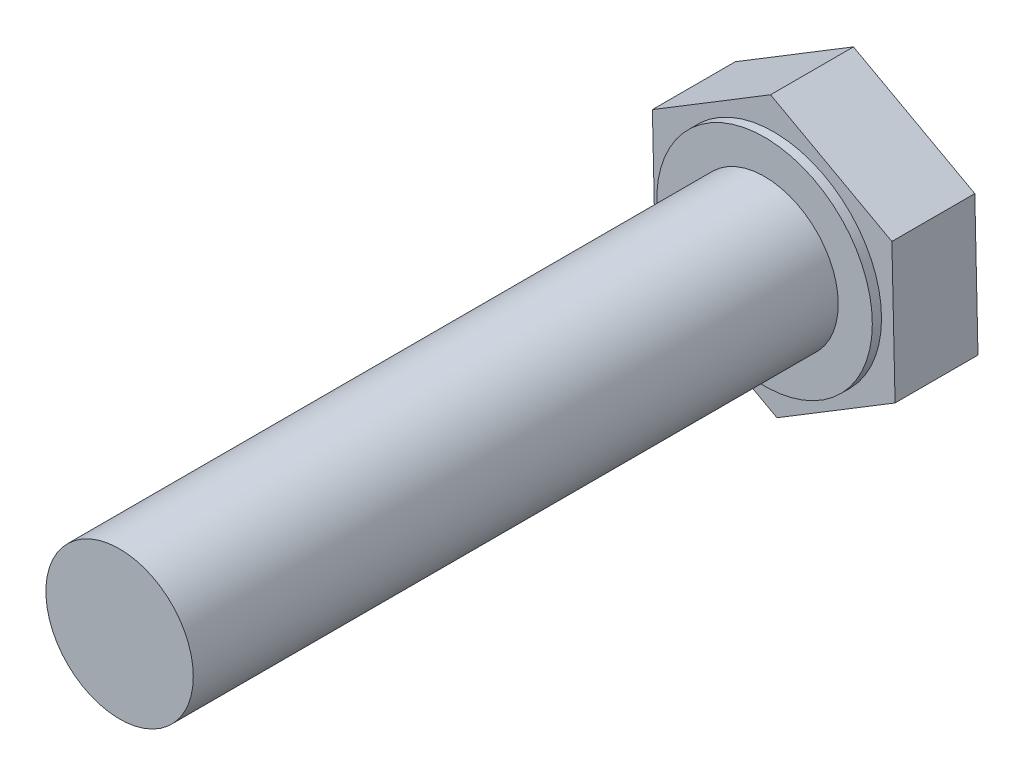
ISO-10303-21;
HEADER;
FILE_DESCRIPTION(('STEP AP214'),'2;1');
FILE_NAME('part.step','',(''),(''),'','','');
FILE_SCHEMA(('AUTOMOTIVE_DESIGN { 1 0 10303 214 1 1 1 1 }'));
ENDSEC;
DATA;
#1=APPLICATION_CONTEXT('core data for automotive mechanical design processes');
#2=APPLICATION_PROTOCOL_DEFINITION('international standard','automotive_design',2000,#1);
#3=PRODUCT_CONTEXT('',#1,'mechanical');
#4=PRODUCT('Part','Part','',(#3));
#5=PRODUCT_RELATED_PRODUCT_CATEGORY('part','',(#4));
#6=PRODUCT_DEFINITION_FORMATION('','',#4);
#7=PRODUCT_DEFINITION_CONTEXT('part definition',#1,'design');
#8=PRODUCT_DEFINITION('design','',#6,#7);
#9=PRODUCT_DEFINITION_SHAPE('','',#8);
#10=(LENGTH_UNIT() NAMED_UNIT(*) SI_UNIT(.MILLI.,.METRE.));
#11=(NAMED_UNIT(*) PLANE_ANGLE_UNIT() SI_UNIT($,.RADIAN.));
#12=(NAMED_UNIT(*) SI_UNIT($,.STERADIAN.) SOLID_ANGLE_UNIT());
#13=UNCERTAINTY_MEASURE_WITH_UNIT(LENGTH_MEASURE(1.E-05),#10,'distance_accuracy_value','');
#14=(GEOMETRIC_REPRESENTATION_CONTEXT(3) GLOBAL_UNCERTAINTY_ASSIGNED_CONTEXT((#13)) GLOBAL_UNIT_ASSIGNED_CONTEXT((#10,
#11,#12)) REPRESENTATION_CONTEXT('',''));
#15=CARTESIAN_POINT('',(0.,0.,0.));
#16=DIRECTION('',(0.,0.,1.));
#17=DIRECTION('',(1.,0.,0.));
#18=AXIS2_PLACEMENT_3D('',#15,#16,#17);
#19=CARTESIAN_POINT('',(-6.58498311375205,3.60157336797873,4.5));
#20=DIRECTION('',(0.999732976991626,0.0231078929255952,0.));
#21=DIRECTION('',(-0.0231078929255952,0.999732976991626,0.));
#22=AXIS2_PLACEMENT_3D('',#19,#20,#21);
#23=PLANE('',#22);
#24=DIRECTION('',(0.0231078929255952,-0.999732976991626,0.));
#25=VECTOR('',#24,1.);
#26=CARTESIAN_POINT('',(-6.58498311375205,3.60157336797873,0.));
#27=LINE('',#26,#25);
#28=CARTESIAN_POINT('',(-6.58498311375205,3.60157336797873,0.));
#29=VERTEX_POINT('',#28);
#30=CARTESIAN_POINT('',(-6.41154558713909,-3.90197597601147,0.));
#31=VERTEX_POINT('',#30);
#32=EDGE_CURVE('E124',#29,#31,#27,.T.);
#33=ORIENTED_EDGE('',*,*,#32,.T.);
#34=DIRECTION('',(0.,0.,-1.));
#35=VECTOR('',#34,1.);
#36=CARTESIAN_POINT('',(-6.41154558713909,-3.90197597601147,4.5));
#37=LINE('',#36,#35);
#38=CARTESIAN_POINT('',(-6.41154558713909,-3.90197597601147,4.5));
#39=VERTEX_POINT('',#38);
#40=EDGE_CURVE('E40',#39,#31,#37,.T.);
#41=ORIENTED_EDGE('',*,*,#40,.F.);
#42=DIRECTION('',(0.0231078929255952,-0.999732976991626,0.));
#43=VECTOR('',#42,1.);
#44=CARTESIAN_POINT('',(-6.58498311375205,3.60157336797873,4.5));
#45=LINE('',#44,#43);
#46=CARTESIAN_POINT('',(-6.58498311375205,3.60157336797873,4.5));
#47=VERTEX_POINT('',#46);
#48=EDGE_CURVE('E135',#47,#39,#45,.T.);
#49=ORIENTED_EDGE('',*,*,#48,.F.);
#50=DIRECTION('',(0.,0.,-1.));
#51=VECTOR('',#50,1.);
#52=CARTESIAN_POINT('',(-6.58498311375205,3.60157336797873,4.5));
#53=LINE('',#52,#51);
#54=EDGE_CURVE('E120',#47,#29,#53,.T.);
#55=ORIENTED_EDGE('',*,*,#54,.T.);
#56=EDGE_LOOP('',(#33,#41,#49,#55));
#57=FACE_BOUND('',#56,.T.);
#58=ADVANCED_FACE('F37',(#57),#23,.F.);
#59=CARTESIAN_POINT('',(-6.41154558713909,-3.90197597601147,4.5));
#60=DIRECTION('',(0.479854466194317,0.87734810153859,0.));
#61=DIRECTION('',(-0.87734810153859,0.479854466194317,0.));
#62=AXIS2_PLACEMENT_3D('',#59,#60,#61);
#63=PLANE('',#62);
#64=DIRECTION('',(0.87734810153859,-0.479854466194317,0.));
#65=VECTOR('',#64,1.);
#66=CARTESIAN_POINT('',(-6.41154558713909,-3.90197597601147,0.));
#67=LINE('',#66,#65);
#68=CARTESIAN_POINT('',(0.173437526612967,-7.5035493439902,0.));
#69=VERTEX_POINT('',#68);
#70=EDGE_CURVE('E127',#31,#69,#67,.T.);
#71=ORIENTED_EDGE('',*,*,#70,.T.);
#72=DIRECTION('',(0.,0.,-1.));
#73=VECTOR('',#72,1.);
#74=CARTESIAN_POINT('',(0.173437526612967,-7.5035493439902,4.5));
#75=LINE('',#74,#73);
#76=CARTESIAN_POINT('',(0.173437526612967,-7.5035493439902,4.5));
#77=VERTEX_POINT('',#76);
#78=EDGE_CURVE('E138',#77,#69,#75,.T.);
#79=ORIENTED_EDGE('',*,*,#78,.F.);
#80=DIRECTION('',(0.87734810153859,-0.479854466194317,0.));
#81=VECTOR('',#80,1.);
#82=CARTESIAN_POINT('',(-6.41154558713909,-3.90197597601147,4.5));
#83=LINE('',#82,#81);
#84=EDGE_CURVE('E93',#39,#77,#83,.T.);
#85=ORIENTED_EDGE('',*,*,#84,.F.);
#86=ORIENTED_EDGE('',*,*,#40,.T.);
#87=EDGE_LOOP('',(#71,#79,#85,#86));
#88=FACE_BOUND('',#87,.T.);
#89=ADVANCED_FACE('F151',(#88),#63,.F.);
#90=CARTESIAN_POINT('',(0.173437526612967,-7.5035493439902,4.5));
#91=DIRECTION('',(-0.51987851079731,0.854240208612994,0.));
#92=DIRECTION('',(-0.854240208612994,-0.51987851079731,0.));
#93=AXIS2_PLACEMENT_3D('',#90,#91,#92);
#94=PLANE('',#93);
#95=DIRECTION('',(0.854240208612994,0.51987851079731,0.));
#96=VECTOR('',#95,1.);
#97=CARTESIAN_POINT('',(0.173437526612967,-7.5035493439902,0.));
#98=LINE('',#97,#96);
#99=CARTESIAN_POINT('',(6.58498311375205,-3.60157336797873,0.));
#100=VERTEX_POINT('',#99);
#101=EDGE_CURVE('E130',#69,#100,#98,.T.);
#102=ORIENTED_EDGE('',*,*,#101,.T.);
#103=DIRECTION('',(0.,0.,-1.));
#104=VECTOR('',#103,1.);
#105=CARTESIAN_POINT('',(6.58498311375205,-3.60157336797873,4.5));
#106=LINE('',#105,#104);
#107=CARTESIAN_POINT('',(6.58498311375205,-3.60157336797873,4.5));
#108=VERTEX_POINT('',#107);
#109=EDGE_CURVE('E115',#108,#100,#106,.T.);
#110=ORIENTED_EDGE('',*,*,#109,.F.);
#111=DIRECTION('',(0.854240208612994,0.51987851079731,0.));
#112=VECTOR('',#111,1.);
#113=CARTESIAN_POINT('',(0.173437526612967,-7.5035493439902,4.5));
#114=LINE('',#113,#112);
#115=EDGE_CURVE('E106',#77,#108,#114,.T.);
#116=ORIENTED_EDGE('',*,*,#115,.F.);
#117=ORIENTED_EDGE('',*,*,#78,.T.);
#118=EDGE_LOOP('',(#102,#110,#116,#117));
#119=FACE_BOUND('',#118,.T.);
#120=ADVANCED_FACE('F152',(#119),#94,.F.);
#121=CARTESIAN_POINT('',(6.58498311375205,-3.60157336797873,4.5));
#122=DIRECTION('',(-0.999732976991626,-0.0231078929255954,0.));
#123=DIRECTION('',(0.0231078929255954,-0.999732976991626,0.));
#124=AXIS2_PLACEMENT_3D('',#121,#122,#123);
#125=PLANE('',#124);
#126=DIRECTION('',(-0.0231078929255954,0.999732976991626,0.));
#127=VECTOR('',#126,1.);
#128=CARTESIAN_POINT('',(6.58498311375205,-3.60157336797873,0.));
#129=LINE('',#128,#127);
#130=CARTESIAN_POINT('',(6.41154558713909,3.90197597601147,0.));
#131=VERTEX_POINT('',#130);
#132=EDGE_CURVE('E114',#100,#131,#129,.T.);
#133=ORIENTED_EDGE('',*,*,#132,.T.);
#134=DIRECTION('',(0.,0.,-1.));
#135=VECTOR('',#134,1.);
#136=CARTESIAN_POINT('',(6.41154558713909,3.90197597601147,4.5));
#137=LINE('',#136,#135);
#138=CARTESIAN_POINT('',(6.41154558713909,3.90197597601147,4.5));
#139=VERTEX_POINT('',#138);
#140=EDGE_CURVE('E111',#139,#131,#137,.T.);
#141=ORIENTED_EDGE('',*,*,#140,.F.);
#142=DIRECTION('',(-0.0231078929255954,0.999732976991626,0.));
#143=VECTOR('',#142,1.);
#144=CARTESIAN_POINT('',(6.58498311375205,-3.60157336797873,4.5));
#145=LINE('',#144,#143);
#146=EDGE_CURVE('E100',#108,#139,#145,.T.);
#147=ORIENTED_EDGE('',*,*,#146,.F.);
#148=ORIENTED_EDGE('',*,*,#109,.T.);
#149=EDGE_LOOP('',(#133,#141,#147,#148));
#150=FACE_BOUND('',#149,.T.);
#151=ADVANCED_FACE('F112',(#150),#125,.F.);
#152=CARTESIAN_POINT('',(6.41154558713909,3.90197597601147,4.5));
#153=DIRECTION('',(-0.479854466194317,-0.87734810153859,0.));
#154=DIRECTION('',(0.87734810153859,-0.479854466194317,0.));
#155=AXIS2_PLACEMENT_3D('',#152,#153,#154);
#156=PLANE('',#155);
#157=DIRECTION('',(-0.87734810153859,0.479854466194317,0.));
#158=VECTOR('',#157,1.);
#159=CARTESIAN_POINT('',(6.41154558713909,3.90197597601147,0.));
#160=LINE('',#159,#158);
#161=CARTESIAN_POINT('',(-0.173437526612968,7.5035493439902,0.));
#162=VERTEX_POINT('',#161);
#163=EDGE_CURVE('E78',#131,#162,#160,.T.);
#164=ORIENTED_EDGE('',*,*,#163,.T.);
#165=DIRECTION('',(0.,0.,-1.));
#166=VECTOR('',#165,1.);
#167=CARTESIAN_POINT('',(-0.173437526612968,7.5035493439902,4.5));
#168=LINE('',#167,#166);
#169=CARTESIAN_POINT('',(-0.173437526612968,7.5035493439902,4.5));
#170=VERTEX_POINT('',#169);
#171=EDGE_CURVE('E116',#170,#162,#168,.T.);
#172=ORIENTED_EDGE('',*,*,#171,.F.);
#173=DIRECTION('',(-0.87734810153859,0.479854466194317,0.));
#174=VECTOR('',#173,1.);
#175=CARTESIAN_POINT('',(6.41154558713909,3.90197597601147,4.5));
#176=LINE('',#175,#174);
#177=EDGE_CURVE('E104',#139,#170,#176,.T.);
#178=ORIENTED_EDGE('',*,*,#177,.F.);
#179=ORIENTED_EDGE('',*,*,#140,.T.);
#180=EDGE_LOOP('',(#164,#172,#178,#179));
#181=FACE_BOUND('',#180,.T.);
#182=ADVANCED_FACE('F118',(#181),#156,.F.);
#183=CARTESIAN_POINT('',(-0.173437526612968,7.5035493439902,4.5));
#184=DIRECTION('',(0.51987851079731,-0.854240208612994,0.));
#185=DIRECTION('',(0.854240208612994,0.51987851079731,0.));
#186=AXIS2_PLACEMENT_3D('',#183,#184,#185);
#187=PLANE('',#186);
#188=DIRECTION('',(-0.854240208612994,-0.51987851079731,0.));
#189=VECTOR('',#188,1.);
#190=CARTESIAN_POINT('',(-0.173437526612968,7.5035493439902,0.));
#191=LINE('',#190,#189);
#192=EDGE_CURVE('E84',#162,#29,#191,.T.);
#193=ORIENTED_EDGE('',*,*,#192,.T.);
#194=ORIENTED_EDGE('',*,*,#54,.F.);
#195=DIRECTION('',(-0.854240208612994,-0.51987851079731,0.));
#196=VECTOR('',#195,1.);
#197=CARTESIAN_POINT('',(-0.173437526612968,7.5035493439902,4.5));
#198=LINE('',#197,#196);
#199=EDGE_CURVE('E55',#170,#47,#198,.T.);
#200=ORIENTED_EDGE('',*,*,#199,.F.);
#201=ORIENTED_EDGE('',*,*,#171,.T.);
#202=EDGE_LOOP('',(#193,#194,#200,#201));
#203=FACE_BOUND('',#202,.T.);
#204=ADVANCED_FACE('F157',(#203),#187,.F.);
#205=CARTESIAN_POINT('',(0.,0.,4.5));
#206=DIRECTION('',(0.,0.,1.));
#207=DIRECTION('',(1.,0.,0.));
#208=AXIS2_PLACEMENT_3D('',#205,#206,#207);
#209=PLANE('',#208);
#210=CARTESIAN_POINT('',(0.,0.,4.5));
#211=DIRECTION('',(0.,0.,1.));
#212=DIRECTION('',(1.,0.,0.));
#213=AXIS2_PLACEMENT_3D('',#210,#211,#212);
#214=CIRCLE('',#213,5.85);
#215=CARTESIAN_POINT('',(5.85,0.,4.5));
#216=VERTEX_POINT('',#215);
#217=EDGE_CURVE('E46',#216,#216,#214,.T.);
#218=ORIENTED_EDGE('',*,*,#217,.F.);
#219=EDGE_LOOP('',(#218));
#220=FACE_BOUND('',#219,.T.);
#221=ORIENTED_EDGE('',*,*,#48,.T.);
#222=ORIENTED_EDGE('',*,*,#84,.T.);
#223=ORIENTED_EDGE('',*,*,#115,.T.);
#224=ORIENTED_EDGE('',*,*,#146,.T.);
#225=ORIENTED_EDGE('',*,*,#177,.T.);
#226=ORIENTED_EDGE('',*,*,#199,.T.);
#227=EDGE_LOOP('',(#221,#222,#223,#224,#225,#226));
#228=FACE_BOUND('',#227,.T.);
#229=ADVANCED_FACE('F102',(#220,#228),#209,.T.);
#230=CARTESIAN_POINT('',(0.,0.,0.));
#231=DIRECTION('',(0.,0.,1.));
#232=DIRECTION('',(1.,0.,0.));
#233=AXIS2_PLACEMENT_3D('',#230,#231,#232);
#234=PLANE('',#233);
#235=ORIENTED_EDGE('',*,*,#32,.F.);
#236=ORIENTED_EDGE('',*,*,#192,.F.);
#237=ORIENTED_EDGE('',*,*,#163,.F.);
#238=ORIENTED_EDGE('',*,*,#132,.F.);
#239=ORIENTED_EDGE('',*,*,#101,.F.);
#240=ORIENTED_EDGE('',*,*,#70,.F.);
#241=EDGE_LOOP('',(#235,#236,#237,#238,#239,#240));
#242=FACE_BOUND('',#241,.T.);
#243=ADVANCED_FACE('F155',(#242),#234,.F.);
#244=CARTESIAN_POINT('',(0.,0.,5.));
#245=DIRECTION('',(0.,0.,-1.));
#246=DIRECTION('',(-1.,0.,0.));
#247=AXIS2_PLACEMENT_3D('',#244,#245,#246);
#248=CYLINDRICAL_SURFACE('',#247,5.85);
#249=CARTESIAN_POINT('',(0.,0.,5.));
#250=DIRECTION('',(0.,0.,1.));
#251=DIRECTION('',(1.,0.,0.));
#252=AXIS2_PLACEMENT_3D('',#249,#250,#251);
#253=CIRCLE('',#252,5.85);
#254=CARTESIAN_POINT('',(5.85,0.,5.));
#255=VERTEX_POINT('',#254);
#256=EDGE_CURVE('E128',#255,#255,#253,.T.);
#257=ORIENTED_EDGE('',*,*,#256,.F.);
#258=EDGE_LOOP('',(#257));
#259=FACE_BOUND('',#258,.T.);
#260=ORIENTED_EDGE('',*,*,#217,.T.);
#261=EDGE_LOOP('',(#260));
#262=FACE_BOUND('',#261,.T.);
#263=ADVANCED_FACE('F200',(#259,#262),#248,.T.);
#264=CARTESIAN_POINT('',(0.,0.,5.));
#265=DIRECTION('',(0.,0.,1.));
#266=DIRECTION('',(1.,0.,0.));
#267=AXIS2_PLACEMENT_3D('',#264,#265,#266);
#268=PLANE('',#267);
#269=CARTESIAN_POINT('',(0.,0.,5.));
#270=DIRECTION('',(0.,0.,1.));
#271=DIRECTION('',(1.,0.,0.));
#272=AXIS2_PLACEMENT_3D('',#269,#270,#271);
#273=CIRCLE('',#272,4.);
#274=CARTESIAN_POINT('',(4.,0.,5.));
#275=VERTEX_POINT('',#274);
#276=EDGE_CURVE('E11',#275,#275,#273,.T.);
#277=ORIENTED_EDGE('',*,*,#276,.F.);
#278=EDGE_LOOP('',(#277));
#279=FACE_BOUND('',#278,.T.);
#280=ORIENTED_EDGE('',*,*,#256,.T.);
#281=EDGE_LOOP('',(#280));
#282=FACE_BOUND('',#281,.T.);
#283=ADVANCED_FACE('F213',(#279,#282),#268,.T.);
#284=CARTESIAN_POINT('',(0.,0.,40.));
#285=DIRECTION('',(0.,0.,-1.));
#286=DIRECTION('',(-1.,0.,0.));
#287=AXIS2_PLACEMENT_3D('',#284,#285,#286);
#288=CYLINDRICAL_SURFACE('',#287,4.);
#289=CARTESIAN_POINT('',(0.,0.,40.));
#290=DIRECTION('',(0.,0.,1.));
#291=DIRECTION('',(1.,0.,0.));
#292=AXIS2_PLACEMENT_3D('',#289,#290,#291);
#293=CIRCLE('',#292,4.);
#294=CARTESIAN_POINT('',(4.,0.,40.));
#295=VERTEX_POINT('',#294);
#296=EDGE_CURVE('E253',#295,#295,#293,.T.);
#297=ORIENTED_EDGE('',*,*,#296,.F.);
#298=EDGE_LOOP('',(#297));
#299=FACE_BOUND('',#298,.T.);
#300=ORIENTED_EDGE('',*,*,#276,.T.);
#301=EDGE_LOOP('',(#300));
#302=FACE_BOUND('',#301,.T.);
#303=ADVANCED_FACE('F223',(#299,#302),#288,.T.);
#304=CARTESIAN_POINT('',(0.,0.,40.));
#305=DIRECTION('',(0.,0.,1.));
#306=DIRECTION('',(1.,0.,0.));
#307=AXIS2_PLACEMENT_3D('',#304,#305,#306);
#308=PLANE('',#307);
#309=ORIENTED_EDGE('',*,*,#296,.T.);
#310=EDGE_LOOP('',(#309));
#311=FACE_BOUND('',#310,.T.);
#312=ADVANCED_FACE('F234',(#311),#308,.T.);
#313=CLOSED_SHELL('',(#58,#89,#120,#151,#182,#204,#229,#243,#263,#283,#303,#312));
#314=MANIFOLD_SOLID_BREP('B2',#313);
#315=ADVANCED_BREP_SHAPE_REPRESENTATION('',(#18,#314),#14);
#316=SHAPE_DEFINITION_REPRESENTATION(#9,#315);
ENDSEC;
END-ISO-10303-21;
